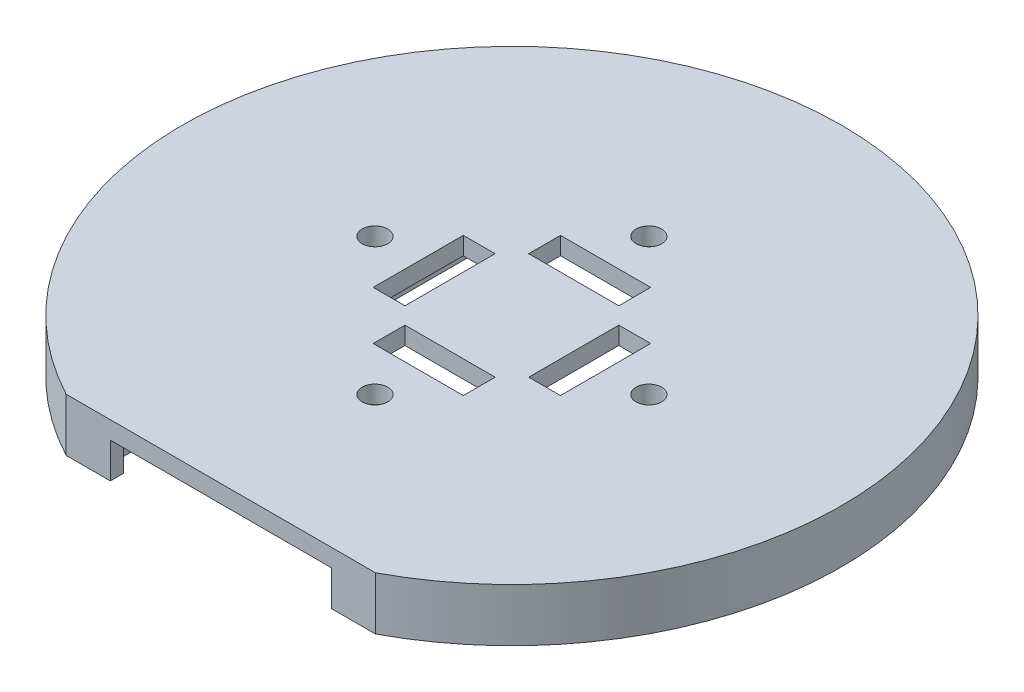
ISO-10303-21;
HEADER;
FILE_DESCRIPTION(('STEP AP214'),'2;1');
FILE_NAME('part.step','',(''),(''),'','','');
FILE_SCHEMA(('AUTOMOTIVE_DESIGN { 1 0 10303 214 1 1 1 1 }'));
ENDSEC;
DATA;
#1=APPLICATION_CONTEXT('core data for automotive mechanical design processes');
#2=APPLICATION_PROTOCOL_DEFINITION('international standard','automotive_design',2000,#1);
#3=PRODUCT_CONTEXT('',#1,'mechanical');
#4=PRODUCT('Part','Part','',(#3));
#5=PRODUCT_RELATED_PRODUCT_CATEGORY('part','',(#4));
#6=PRODUCT_DEFINITION_FORMATION('','',#4);
#7=PRODUCT_DEFINITION_CONTEXT('part definition',#1,'design');
#8=PRODUCT_DEFINITION('design','',#6,#7);
#9=PRODUCT_DEFINITION_SHAPE('','',#8);
#10=(LENGTH_UNIT() NAMED_UNIT(*) SI_UNIT(.MILLI.,.METRE.));
#11=(NAMED_UNIT(*) PLANE_ANGLE_UNIT() SI_UNIT($,.RADIAN.));
#12=(NAMED_UNIT(*) SI_UNIT($,.STERADIAN.) SOLID_ANGLE_UNIT());
#13=UNCERTAINTY_MEASURE_WITH_UNIT(LENGTH_MEASURE(1.E-05),#10,'distance_accuracy_value','');
#14=(GEOMETRIC_REPRESENTATION_CONTEXT(3) GLOBAL_UNCERTAINTY_ASSIGNED_CONTEXT((#13)) GLOBAL_UNIT_ASSIGNED_CONTEXT((#10,
#11,#12)) REPRESENTATION_CONTEXT('',''));
#15=CARTESIAN_POINT('',(0.,0.,0.));
#16=DIRECTION('',(0.,0.,1.));
#17=DIRECTION('',(1.,0.,0.));
#18=AXIS2_PLACEMENT_3D('',#15,#16,#17);
#19=CARTESIAN_POINT('',(-14.15,4.,31.4399453551459));
#20=DIRECTION('',(0.,0.,1.));
#21=DIRECTION('',(1.,0.,0.));
#22=AXIS2_PLACEMENT_3D('',#19,#20,#21);
#23=PLANE('',#22);
#24=DIRECTION('',(-1.,0.,0.));
#25=VECTOR('',#24,1.);
#26=CARTESIAN_POINT('',(-14.15,0.,31.4399453551459));
#27=LINE('',#26,#25);
#28=CARTESIAN_POINT('',(14.15,0.,31.4399453551459));
#29=VERTEX_POINT('',#28);
#30=CARTESIAN_POINT('',(12.5,0.,31.4399453551459));
#31=VERTEX_POINT('',#30);
#32=EDGE_CURVE('E260',#29,#31,#27,.T.);
#33=ORIENTED_EDGE('',*,*,#32,.T.);
#34=DIRECTION('',(0.,-1.,0.));
#35=VECTOR('',#34,1.);
#36=CARTESIAN_POINT('',(12.5,0.,31.4399453551459));
#37=LINE('',#36,#35);
#38=CARTESIAN_POINT('',(12.5,4.,31.4399453551459));
#39=VERTEX_POINT('',#38);
#40=EDGE_CURVE('E242',#39,#31,#37,.T.);
#41=ORIENTED_EDGE('',*,*,#40,.F.);
#42=DIRECTION('',(-1.,0.,0.));
#43=VECTOR('',#42,1.);
#44=CARTESIAN_POINT('',(-14.15,4.,31.4399453551459));
#45=LINE('',#44,#43);
#46=CARTESIAN_POINT('',(14.15,4.,31.4399453551459));
#47=VERTEX_POINT('',#46);
#48=EDGE_CURVE('E258',#47,#39,#45,.T.);
#49=ORIENTED_EDGE('',*,*,#48,.F.);
#50=DIRECTION('',(0.,-1.,0.));
#51=VECTOR('',#50,1.);
#52=CARTESIAN_POINT('',(14.15,4.,31.4399453551459));
#53=LINE('',#52,#51);
#54=EDGE_CURVE('E288',#47,#29,#53,.T.);
#55=ORIENTED_EDGE('',*,*,#54,.T.);
#56=EDGE_LOOP('',(#33,#41,#49,#55));
#57=FACE_BOUND('',#56,.T.);
#58=ADVANCED_FACE('F42',(#57),#23,.F.);
#59=CARTESIAN_POINT('',(14.15,4.,31.4399453551459));
#60=DIRECTION('',(1.,0.,0.));
#61=DIRECTION('',(0.,0.,-1.));
#62=AXIS2_PLACEMENT_3D('',#59,#60,#61);
#63=PLANE('',#62);
#64=DIRECTION('',(0.,0.,1.));
#65=VECTOR('',#64,1.);
#66=CARTESIAN_POINT('',(14.15,0.,31.4399453551459));
#67=LINE('',#66,#65);
#68=CARTESIAN_POINT('',(14.15,0.,-32.8600546448541));
#69=VERTEX_POINT('',#68);
#70=CARTESIAN_POINT('',(14.15,0.,-0.529150262213086));
#71=VERTEX_POINT('',#70);
#72=EDGE_CURVE('E289',#69,#71,#67,.T.);
#73=ORIENTED_EDGE('',*,*,#72,.T.);
#74=DIRECTION('',(0.,1.,0.));
#75=VECTOR('',#74,1.);
#76=CARTESIAN_POINT('',(14.15,0.,-0.529150262213088));
#77=LINE('',#76,#75);
#78=CARTESIAN_POINT('',(14.15,4.,-0.529150262213086));
#79=VERTEX_POINT('',#78);
#80=EDGE_CURVE('E512',#71,#79,#77,.T.);
#81=ORIENTED_EDGE('',*,*,#80,.T.);
#82=DIRECTION('',(0.,0.,1.));
#83=VECTOR('',#82,1.);
#84=CARTESIAN_POINT('',(14.15,4.,31.4399453551459));
#85=LINE('',#84,#83);
#86=CARTESIAN_POINT('',(14.15,4.,-32.8600546448541));
#87=VERTEX_POINT('',#86);
#88=EDGE_CURVE('E278',#87,#79,#85,.T.);
#89=ORIENTED_EDGE('',*,*,#88,.F.);
#90=DIRECTION('',(0.,-1.,0.));
#91=VECTOR('',#90,1.);
#92=CARTESIAN_POINT('',(14.15,4.,-32.8600546448541));
#93=LINE('',#92,#91);
#94=EDGE_CURVE('E306',#87,#69,#93,.T.);
#95=ORIENTED_EDGE('',*,*,#94,.T.);
#96=EDGE_LOOP('',(#73,#81,#89,#95));
#97=FACE_BOUND('',#96,.T.);
#98=ADVANCED_FACE('F628',(#97),#63,.F.);
#99=CARTESIAN_POINT('',(-14.15,4.,31.4399453551459));
#100=DIRECTION('',(-1.,0.,0.));
#101=DIRECTION('',(0.,0.,1.));
#102=AXIS2_PLACEMENT_3D('',#99,#100,#101);
#103=PLANE('',#102);
#104=DIRECTION('',(0.,0.,-1.));
#105=VECTOR('',#104,1.);
#106=CARTESIAN_POINT('',(-14.15,0.,31.4399453551459));
#107=LINE('',#106,#105);
#108=CARTESIAN_POINT('',(-14.15,0.,31.4399453551459));
#109=VERTEX_POINT('',#108);
#110=CARTESIAN_POINT('',(-14.15,0.,0.529150262212975));
#111=VERTEX_POINT('',#110);
#112=EDGE_CURVE('E298',#109,#111,#107,.T.);
#113=ORIENTED_EDGE('',*,*,#112,.T.);
#114=DIRECTION('',(0.,1.,0.));
#115=VECTOR('',#114,1.);
#116=CARTESIAN_POINT('',(-14.15,0.,0.529150262212975));
#117=LINE('',#116,#115);
#118=CARTESIAN_POINT('',(-14.15,4.,0.529150262212975));
#119=VERTEX_POINT('',#118);
#120=EDGE_CURVE('E410',#111,#119,#117,.T.);
#121=ORIENTED_EDGE('',*,*,#120,.T.);
#122=DIRECTION('',(0.,0.,-1.));
#123=VECTOR('',#122,1.);
#124=CARTESIAN_POINT('',(-14.15,4.,31.4399453551459));
#125=LINE('',#124,#123);
#126=CARTESIAN_POINT('',(-14.15,4.,31.4399453551459));
#127=VERTEX_POINT('',#126);
#128=EDGE_CURVE('E276',#127,#119,#125,.T.);
#129=ORIENTED_EDGE('',*,*,#128,.F.);
#130=DIRECTION('',(0.,-1.,0.));
#131=VECTOR('',#130,1.);
#132=CARTESIAN_POINT('',(-14.15,4.,31.4399453551459));
#133=LINE('',#132,#131);
#134=EDGE_CURVE('E314',#127,#109,#133,.T.);
#135=ORIENTED_EDGE('',*,*,#134,.T.);
#136=EDGE_LOOP('',(#113,#121,#129,#135));
#137=FACE_BOUND('',#136,.T.);
#138=ADVANCED_FACE('F416',(#137),#103,.F.);
#139=CARTESIAN_POINT('',(0.,6.,0.));
#140=DIRECTION('',(0.,-1.,0.));
#141=DIRECTION('',(0.,0.,-1.));
#142=AXIS2_PLACEMENT_3D('',#139,#140,#141);
#143=CYLINDRICAL_SURFACE('',#142,37.3);
#144=CARTESIAN_POINT('',(0.,0.,0.));
#145=DIRECTION('',(0.,1.,0.));
#146=DIRECTION('',(0.,0.,1.));
#147=AXIS2_PLACEMENT_3D('',#144,#145,#146);
#148=CIRCLE('',#147,37.3);
#149=CARTESIAN_POINT('',(17.5,0.,32.9399453551459));
#150=VERTEX_POINT('',#149);
#151=CARTESIAN_POINT('',(-17.5,0.,32.9399453551459));
#152=VERTEX_POINT('',#151);
#153=EDGE_CURVE('E309',#150,#152,#148,.T.);
#154=ORIENTED_EDGE('',*,*,#153,.T.);
#155=DIRECTION('',(0.,-1.,0.));
#156=VECTOR('',#155,1.);
#157=CARTESIAN_POINT('',(-17.5,6.,32.9399453551459));
#158=LINE('',#157,#156);
#159=CARTESIAN_POINT('',(-17.5,6.,32.9399453551459));
#160=VERTEX_POINT('',#159);
#161=EDGE_CURVE('E339',#160,#152,#158,.T.);
#162=ORIENTED_EDGE('',*,*,#161,.F.);
#163=CARTESIAN_POINT('',(0.,6.,0.));
#164=DIRECTION('',(0.,1.,0.));
#165=DIRECTION('',(0.,0.,1.));
#166=AXIS2_PLACEMENT_3D('',#163,#164,#165);
#167=CIRCLE('',#166,37.3);
#168=CARTESIAN_POINT('',(17.5,6.,32.9399453551459));
#169=VERTEX_POINT('',#168);
#170=EDGE_CURVE('E320',#169,#160,#167,.T.);
#171=ORIENTED_EDGE('',*,*,#170,.F.);
#172=DIRECTION('',(0.,-1.,0.));
#173=VECTOR('',#172,1.);
#174=CARTESIAN_POINT('',(17.5,6.,32.9399453551459));
#175=LINE('',#174,#173);
#176=EDGE_CURVE('E328',#169,#150,#175,.T.);
#177=ORIENTED_EDGE('',*,*,#176,.T.);
#178=EDGE_LOOP('',(#154,#162,#171,#177));
#179=FACE_BOUND('',#178,.T.);
#180=ADVANCED_FACE('F44',(#179),#143,.T.);
#181=CARTESIAN_POINT('',(-17.5,6.,32.9399453551459));
#182=DIRECTION('',(0.,0.,-1.));
#183=DIRECTION('',(-1.,0.,0.));
#184=AXIS2_PLACEMENT_3D('',#181,#182,#183);
#185=PLANE('',#184);
#186=DIRECTION('',(-1.,0.,0.));
#187=VECTOR('',#186,1.);
#188=CARTESIAN_POINT('',(-12.5,4.,32.9399453551459));
#189=LINE('',#188,#187);
#190=CARTESIAN_POINT('',(12.5,4.,32.9399453551459));
#191=VERTEX_POINT('',#190);
#192=CARTESIAN_POINT('',(-12.5,4.,32.9399453551459));
#193=VERTEX_POINT('',#192);
#194=EDGE_CURVE('E683',#191,#193,#189,.T.);
#195=ORIENTED_EDGE('',*,*,#194,.F.);
#196=DIRECTION('',(0.,1.,0.));
#197=VECTOR('',#196,1.);
#198=CARTESIAN_POINT('',(12.5,0.,32.9399453551459));
#199=LINE('',#198,#197);
#200=CARTESIAN_POINT('',(12.5,0.,32.9399453551459));
#201=VERTEX_POINT('',#200);
#202=EDGE_CURVE('E245',#201,#191,#199,.T.);
#203=ORIENTED_EDGE('',*,*,#202,.F.);
#204=DIRECTION('',(1.,0.,0.));
#205=VECTOR('',#204,1.);
#206=CARTESIAN_POINT('',(-17.5,0.,32.9399453551459));
#207=LINE('',#206,#205);
#208=EDGE_CURVE('E332',#201,#150,#207,.T.);
#209=ORIENTED_EDGE('',*,*,#208,.T.);
#210=ORIENTED_EDGE('',*,*,#176,.F.);
#211=DIRECTION('',(1.,0.,0.));
#212=VECTOR('',#211,1.);
#213=CARTESIAN_POINT('',(-17.5,6.,32.9399453551459));
#214=LINE('',#213,#212);
#215=EDGE_CURVE('E324',#160,#169,#214,.T.);
#216=ORIENTED_EDGE('',*,*,#215,.F.);
#217=ORIENTED_EDGE('',*,*,#161,.T.);
#218=CARTESIAN_POINT('',(-12.5,0.,32.9399453551459));
#219=VERTEX_POINT('',#218);
#220=EDGE_CURVE('E325',#152,#219,#207,.T.);
#221=ORIENTED_EDGE('',*,*,#220,.T.);
#222=DIRECTION('',(0.,-1.,0.));
#223=VECTOR('',#222,1.);
#224=CARTESIAN_POINT('',(-12.5,0.,32.9399453551459));
#225=LINE('',#224,#223);
#226=EDGE_CURVE('E262',#193,#219,#225,.T.);
#227=ORIENTED_EDGE('',*,*,#226,.F.);
#228=EDGE_LOOP('',(#195,#203,#209,#210,#216,#217,#221,#227));
#229=FACE_BOUND('',#228,.T.);
#230=ADVANCED_FACE('F552',(#229),#185,.F.);
#231=CARTESIAN_POINT('',(0.,6.,0.));
#232=DIRECTION('',(0.,1.,0.));
#233=DIRECTION('',(0.,0.,1.));
#234=AXIS2_PLACEMENT_3D('',#231,#232,#233);
#235=PLANE('',#234);
#236=CARTESIAN_POINT('',(15.5,6.,-1.62353882256206E-13));
#237=DIRECTION('',(0.,1.,0.));
#238=DIRECTION('',(-1.,0.,0.));
#239=AXIS2_PLACEMENT_3D('',#236,#237,#238);
#240=CIRCLE('',#239,1.45);
#241=CARTESIAN_POINT('',(14.05,6.,-1.47165938432238E-13));
#242=VERTEX_POINT('',#241);
#243=EDGE_CURVE('E479',#242,#242,#240,.T.);
#244=ORIENTED_EDGE('',*,*,#243,.F.);
#245=EDGE_LOOP('',(#244));
#246=FACE_BOUND('',#245,.T.);
#247=CARTESIAN_POINT('',(-15.5,6.,0.));
#248=DIRECTION('',(0.,1.,0.));
#249=DIRECTION('',(1.,0.,0.));
#250=AXIS2_PLACEMENT_3D('',#247,#248,#249);
#251=CIRCLE('',#250,1.45);
#252=CARTESIAN_POINT('',(-14.05,6.,0.));
#253=VERTEX_POINT('',#252);
#254=EDGE_CURVE('E435',#253,#253,#251,.T.);
#255=ORIENTED_EDGE('',*,*,#254,.F.);
#256=EDGE_LOOP('',(#255));
#257=FACE_BOUND('',#256,.T.);
#258=DIRECTION('',(0.,0.,1.));
#259=VECTOR('',#258,1.);
#260=CARTESIAN_POINT('',(-5.1,6.,10.6));
#261=LINE('',#260,#259);
#262=CARTESIAN_POINT('',(-5.1,6.,7.));
#263=VERTEX_POINT('',#262);
#264=CARTESIAN_POINT('',(-5.1,6.,10.6));
#265=VERTEX_POINT('',#264);
#266=EDGE_CURVE('E66',#263,#265,#261,.T.);
#267=ORIENTED_EDGE('',*,*,#266,.F.);
#268=DIRECTION('',(-1.,0.,0.));
#269=VECTOR('',#268,1.);
#270=CARTESIAN_POINT('',(5.1,6.,7.));
#271=LINE('',#270,#269);
#272=CARTESIAN_POINT('',(5.1,6.,7.));
#273=VERTEX_POINT('',#272);
#274=EDGE_CURVE('E459',#273,#263,#271,.T.);
#275=ORIENTED_EDGE('',*,*,#274,.F.);
#276=DIRECTION('',(0.,0.,-1.));
#277=VECTOR('',#276,1.);
#278=CARTESIAN_POINT('',(5.1,6.,10.6));
#279=LINE('',#278,#277);
#280=CARTESIAN_POINT('',(5.1,6.,10.6));
#281=VERTEX_POINT('',#280);
#282=EDGE_CURVE('E455',#281,#273,#279,.T.);
#283=ORIENTED_EDGE('',*,*,#282,.F.);
#284=DIRECTION('',(1.,0.,0.));
#285=VECTOR('',#284,1.);
#286=CARTESIAN_POINT('',(5.1,6.,10.6));
#287=LINE('',#286,#285);
#288=EDGE_CURVE('E450',#265,#281,#287,.T.);
#289=ORIENTED_EDGE('',*,*,#288,.F.);
#290=EDGE_LOOP('',(#267,#275,#283,#289));
#291=FACE_BOUND('',#290,.T.);
#292=CARTESIAN_POINT('',(0.,6.,15.5));
#293=DIRECTION('',(0.,1.,0.));
#294=DIRECTION('',(0.,0.,-1.));
#295=AXIS2_PLACEMENT_3D('',#292,#293,#294);
#296=CIRCLE('',#295,1.45);
#297=CARTESIAN_POINT('',(0.,6.,14.05));
#298=VERTEX_POINT('',#297);
#299=EDGE_CURVE('E451',#298,#298,#296,.T.);
#300=ORIENTED_EDGE('',*,*,#299,.F.);
#301=EDGE_LOOP('',(#300));
#302=FACE_BOUND('',#301,.T.);
#303=DIRECTION('',(1.,0.,0.));
#304=VECTOR('',#303,1.);
#305=CARTESIAN_POINT('',(10.6000000000001,6.,5.09999999999989));
#306=LINE('',#305,#304);
#307=CARTESIAN_POINT('',(7.00000000000005,6.,5.09999999999993));
#308=VERTEX_POINT('',#307);
#309=CARTESIAN_POINT('',(10.6000000000001,6.,5.09999999999989));
#310=VERTEX_POINT('',#309);
#311=EDGE_CURVE('E478',#308,#310,#306,.T.);
#312=ORIENTED_EDGE('',*,*,#311,.F.);
#313=DIRECTION('',(0.,0.,1.));
#314=VECTOR('',#313,1.);
#315=CARTESIAN_POINT('',(6.99999999999995,6.,-5.10000000000007));
#316=LINE('',#315,#314);
#317=CARTESIAN_POINT('',(6.99999999999995,6.,-5.10000000000007));
#318=VERTEX_POINT('',#317);
#319=EDGE_CURVE('E582',#318,#308,#316,.T.);
#320=ORIENTED_EDGE('',*,*,#319,.F.);
#321=DIRECTION('',(-1.,0.,0.));
#322=VECTOR('',#321,1.);
#323=CARTESIAN_POINT('',(10.5999999999999,6.,-5.10000000000011));
#324=LINE('',#323,#322);
#325=CARTESIAN_POINT('',(10.5999999999999,6.,-5.10000000000011));
#326=VERTEX_POINT('',#325);
#327=EDGE_CURVE('E578',#326,#318,#324,.T.);
#328=ORIENTED_EDGE('',*,*,#327,.F.);
#329=DIRECTION('',(0.,0.,-1.));
#330=VECTOR('',#329,1.);
#331=CARTESIAN_POINT('',(10.5999999999999,6.,-5.10000000000011));
#332=LINE('',#331,#330);
#333=EDGE_CURVE('E574',#310,#326,#332,.T.);
#334=ORIENTED_EDGE('',*,*,#333,.F.);
#335=EDGE_LOOP('',(#312,#320,#328,#334));
#336=FACE_BOUND('',#335,.T.);
#337=DIRECTION('',(-1.,0.,0.));
#338=VECTOR('',#337,1.);
#339=CARTESIAN_POINT('',(-10.6,6.,-5.09999999999996));
#340=LINE('',#339,#338);
#341=CARTESIAN_POINT('',(-7.00000000000002,6.,-5.09999999999997));
#342=VERTEX_POINT('',#341);
#343=CARTESIAN_POINT('',(-10.6,6.,-5.09999999999996));
#344=VERTEX_POINT('',#343);
#345=EDGE_CURVE('E434',#342,#344,#340,.T.);
#346=ORIENTED_EDGE('',*,*,#345,.F.);
#347=DIRECTION('',(0.,0.,-1.));
#348=VECTOR('',#347,1.);
#349=CARTESIAN_POINT('',(-6.99999999999998,6.,5.10000000000002));
#350=LINE('',#349,#348);
#351=CARTESIAN_POINT('',(-6.99999999999998,6.,5.10000000000002));
#352=VERTEX_POINT('',#351);
#353=EDGE_CURVE('E491',#352,#342,#350,.T.);
#354=ORIENTED_EDGE('',*,*,#353,.F.);
#355=DIRECTION('',(1.,0.,0.));
#356=VECTOR('',#355,1.);
#357=CARTESIAN_POINT('',(-10.6,6.,5.10000000000004));
#358=LINE('',#357,#356);
#359=CARTESIAN_POINT('',(-10.6,6.,5.10000000000004));
#360=VERTEX_POINT('',#359);
#361=EDGE_CURVE('E487',#360,#352,#358,.T.);
#362=ORIENTED_EDGE('',*,*,#361,.F.);
#363=DIRECTION('',(0.,0.,1.));
#364=VECTOR('',#363,1.);
#365=CARTESIAN_POINT('',(-10.6,6.,5.10000000000004));
#366=LINE('',#365,#364);
#367=EDGE_CURVE('E439',#344,#360,#366,.T.);
#368=ORIENTED_EDGE('',*,*,#367,.F.);
#369=EDGE_LOOP('',(#346,#354,#362,#368));
#370=FACE_BOUND('',#369,.T.);
#371=DIRECTION('',(0.,0.,-1.));
#372=VECTOR('',#371,1.);
#373=CARTESIAN_POINT('',(5.1,6.,-10.6));
#374=LINE('',#373,#372);
#375=CARTESIAN_POINT('',(5.1,6.,-7.));
#376=VERTEX_POINT('',#375);
#377=CARTESIAN_POINT('',(5.1,6.,-10.6));
#378=VERTEX_POINT('',#377);
#379=EDGE_CURVE('E517',#376,#378,#374,.T.);
#380=ORIENTED_EDGE('',*,*,#379,.F.);
#381=DIRECTION('',(1.,0.,0.));
#382=VECTOR('',#381,1.);
#383=CARTESIAN_POINT('',(-5.1,6.,-7.));
#384=LINE('',#383,#382);
#385=CARTESIAN_POINT('',(-5.1,6.,-7.));
#386=VERTEX_POINT('',#385);
#387=EDGE_CURVE('E528',#386,#376,#384,.T.);
#388=ORIENTED_EDGE('',*,*,#387,.F.);
#389=DIRECTION('',(0.,0.,1.));
#390=VECTOR('',#389,1.);
#391=CARTESIAN_POINT('',(-5.1,6.,-10.6));
#392=LINE('',#391,#390);
#393=CARTESIAN_POINT('',(-5.1,6.,-10.6));
#394=VERTEX_POINT('',#393);
#395=EDGE_CURVE('E524',#394,#386,#392,.T.);
#396=ORIENTED_EDGE('',*,*,#395,.F.);
#397=DIRECTION('',(-1.,0.,0.));
#398=VECTOR('',#397,1.);
#399=CARTESIAN_POINT('',(-5.1,6.,-10.6));
#400=LINE('',#399,#398);
#401=EDGE_CURVE('E520',#378,#394,#400,.T.);
#402=ORIENTED_EDGE('',*,*,#401,.F.);
#403=EDGE_LOOP('',(#380,#388,#396,#402));
#404=FACE_BOUND('',#403,.T.);
#405=CARTESIAN_POINT('',(0.,6.,-15.5));
#406=DIRECTION('',(0.,1.,0.));
#407=DIRECTION('',(0.,0.,1.));
#408=AXIS2_PLACEMENT_3D('',#405,#406,#407);
#409=CIRCLE('',#408,1.45);
#410=CARTESIAN_POINT('',(0.,6.,-14.05));
#411=VERTEX_POINT('',#410);
#412=EDGE_CURVE('E516',#411,#411,#409,.T.);
#413=ORIENTED_EDGE('',*,*,#412,.F.);
#414=EDGE_LOOP('',(#413));
#415=FACE_BOUND('',#414,.T.);
#416=ORIENTED_EDGE('',*,*,#170,.T.);
#417=ORIENTED_EDGE('',*,*,#215,.T.);
#418=EDGE_LOOP('',(#416,#417));
#419=FACE_BOUND('',#418,.T.);
#420=ADVANCED_FACE('F549',(#246,#257,#291,#302,#336,#370,#404,#415,#419),#235,.T.);
#421=CARTESIAN_POINT('',(0.,0.,0.));
#422=DIRECTION('',(0.,1.,0.));
#423=DIRECTION('',(0.,0.,1.));
#424=AXIS2_PLACEMENT_3D('',#421,#422,#423);
#425=PLANE('',#424);
#426=ORIENTED_EDGE('',*,*,#208,.F.);
#427=DIRECTION('',(0.,0.,1.));
#428=VECTOR('',#427,1.);
#429=CARTESIAN_POINT('',(12.5,0.,-37.301));
#430=LINE('',#429,#428);
#431=EDGE_CURVE('E252',#31,#201,#430,.T.);
#432=ORIENTED_EDGE('',*,*,#431,.F.);
#433=ORIENTED_EDGE('',*,*,#32,.F.);
#434=CARTESIAN_POINT('',(14.15,0.,0.529150262212761));
#435=VERTEX_POINT('',#434);
#436=EDGE_CURVE('E294',#435,#29,#67,.T.);
#437=ORIENTED_EDGE('',*,*,#436,.F.);
#438=CARTESIAN_POINT('',(15.5,0.,-1.62353882256206E-13));
#439=DIRECTION('',(0.,1.,0.));
#440=DIRECTION('',(-1.,0.,0.));
#441=AXIS2_PLACEMENT_3D('',#438,#439,#440);
#442=CIRCLE('',#441,1.45);
#443=EDGE_CURVE('E474',#435,#71,#442,.T.);
#444=ORIENTED_EDGE('',*,*,#443,.T.);
#445=ORIENTED_EDGE('',*,*,#72,.F.);
#446=DIRECTION('',(1.,0.,0.));
#447=VECTOR('',#446,1.);
#448=CARTESIAN_POINT('',(-14.15,0.,-32.8600546448541));
#449=LINE('',#448,#447);
#450=CARTESIAN_POINT('',(-14.15,0.,-32.8600546448541));
#451=VERTEX_POINT('',#450);
#452=EDGE_CURVE('E302',#451,#69,#449,.T.);
#453=ORIENTED_EDGE('',*,*,#452,.F.);
#454=CARTESIAN_POINT('',(-14.15,0.,-0.529150262212867));
#455=VERTEX_POINT('',#454);
#456=EDGE_CURVE('E297',#455,#451,#107,.T.);
#457=ORIENTED_EDGE('',*,*,#456,.F.);
#458=CARTESIAN_POINT('',(-15.5,0.,0.));
#459=DIRECTION('',(0.,1.,0.));
#460=DIRECTION('',(1.,0.,0.));
#461=AXIS2_PLACEMENT_3D('',#458,#459,#460);
#462=CIRCLE('',#461,1.45);
#463=EDGE_CURVE('E431',#455,#111,#462,.T.);
#464=ORIENTED_EDGE('',*,*,#463,.T.);
#465=ORIENTED_EDGE('',*,*,#112,.F.);
#466=CARTESIAN_POINT('',(-12.5,0.,31.4399453551459));
#467=VERTEX_POINT('',#466);
#468=EDGE_CURVE('E293',#467,#109,#27,.T.);
#469=ORIENTED_EDGE('',*,*,#468,.F.);
#470=DIRECTION('',(0.,0.,1.));
#471=VECTOR('',#470,1.);
#472=CARTESIAN_POINT('',(-12.5,0.,-37.301));
#473=LINE('',#472,#471);
#474=EDGE_CURVE('E482',#467,#219,#473,.T.);
#475=ORIENTED_EDGE('',*,*,#474,.T.);
#476=ORIENTED_EDGE('',*,*,#220,.F.);
#477=ORIENTED_EDGE('',*,*,#153,.F.);
#478=EDGE_LOOP('',(#426,#432,#433,#437,#444,#445,#453,#457,#464,#465,#469,#475,#476,#477));
#479=FACE_BOUND('',#478,.T.);
#480=ADVANCED_FACE('F428',(#479),#425,.F.);
#481=CARTESIAN_POINT('',(14.15,4.,0.529150262212761));
#482=VERTEX_POINT('',#481);
#483=EDGE_CURVE('E268',#482,#47,#85,.T.);
#484=ORIENTED_EDGE('',*,*,#483,.F.);
#485=DIRECTION('',(0.,1.,0.));
#486=VECTOR('',#485,1.);
#487=CARTESIAN_POINT('',(14.15,0.,0.529150262212763));
#488=LINE('',#487,#486);
#489=EDGE_CURVE('E419',#482,#435,#488,.F.);
#490=ORIENTED_EDGE('',*,*,#489,.T.);
#491=ORIENTED_EDGE('',*,*,#436,.T.);
#492=ORIENTED_EDGE('',*,*,#54,.F.);
#493=EDGE_LOOP('',(#484,#490,#491,#492));
#494=FACE_BOUND('',#493,.T.);
#495=ADVANCED_FACE('F637',(#494),#63,.F.);
#496=CARTESIAN_POINT('',(-14.15,4.,-32.8600546448541));
#497=DIRECTION('',(0.,0.,-1.));
#498=DIRECTION('',(-1.,0.,0.));
#499=AXIS2_PLACEMENT_3D('',#496,#497,#498);
#500=PLANE('',#499);
#501=ORIENTED_EDGE('',*,*,#452,.T.);
#502=ORIENTED_EDGE('',*,*,#94,.F.);
#503=DIRECTION('',(1.,0.,0.));
#504=VECTOR('',#503,1.);
#505=CARTESIAN_POINT('',(-14.15,4.,-32.8600546448541));
#506=LINE('',#505,#504);
#507=CARTESIAN_POINT('',(-14.15,4.,-32.8600546448541));
#508=VERTEX_POINT('',#507);
#509=EDGE_CURVE('E284',#508,#87,#506,.T.);
#510=ORIENTED_EDGE('',*,*,#509,.F.);
#511=DIRECTION('',(0.,-1.,0.));
#512=VECTOR('',#511,1.);
#513=CARTESIAN_POINT('',(-14.15,4.,-32.8600546448541));
#514=LINE('',#513,#512);
#515=EDGE_CURVE('E310',#508,#451,#514,.T.);
#516=ORIENTED_EDGE('',*,*,#515,.T.);
#517=EDGE_LOOP('',(#501,#502,#510,#516));
#518=FACE_BOUND('',#517,.T.);
#519=ADVANCED_FACE('F648',(#518),#500,.F.);
#520=CARTESIAN_POINT('',(-14.15,4.,-0.529150262212867));
#521=VERTEX_POINT('',#520);
#522=EDGE_CURVE('E271',#521,#508,#125,.T.);
#523=ORIENTED_EDGE('',*,*,#522,.F.);
#524=DIRECTION('',(0.,1.,0.));
#525=VECTOR('',#524,1.);
#526=CARTESIAN_POINT('',(-14.15,0.,-0.529150262212867));
#527=LINE('',#526,#525);
#528=EDGE_CURVE('E392',#521,#455,#527,.F.);
#529=ORIENTED_EDGE('',*,*,#528,.T.);
#530=ORIENTED_EDGE('',*,*,#456,.T.);
#531=ORIENTED_EDGE('',*,*,#515,.F.);
#532=EDGE_LOOP('',(#523,#529,#530,#531));
#533=FACE_BOUND('',#532,.T.);
#534=ADVANCED_FACE('F640',(#533),#103,.F.);
#535=CARTESIAN_POINT('',(-12.5,4.,31.4399453551459));
#536=VERTEX_POINT('',#535);
#537=EDGE_CURVE('E272',#536,#127,#45,.T.);
#538=ORIENTED_EDGE('',*,*,#537,.F.);
#539=DIRECTION('',(0.,1.,0.));
#540=VECTOR('',#539,1.);
#541=CARTESIAN_POINT('',(-12.5,0.,31.4399453551459));
#542=LINE('',#541,#540);
#543=EDGE_CURVE('E58',#467,#536,#542,.T.);
#544=ORIENTED_EDGE('',*,*,#543,.F.);
#545=ORIENTED_EDGE('',*,*,#468,.T.);
#546=ORIENTED_EDGE('',*,*,#134,.F.);
#547=EDGE_LOOP('',(#538,#544,#545,#546));
#548=FACE_BOUND('',#547,.T.);
#549=ADVANCED_FACE('F424',(#548),#23,.F.);
#550=CARTESIAN_POINT('',(0.,4.,0.));
#551=DIRECTION('',(0.,-1.,0.));
#552=DIRECTION('',(0.,0.,-1.));
#553=AXIS2_PLACEMENT_3D('',#550,#551,#552);
#554=PLANE('',#553);
#555=CARTESIAN_POINT('',(15.5,4.,-1.62353882256206E-13));
#556=DIRECTION('',(0.,-1.,0.));
#557=DIRECTION('',(0.,0.,-1.));
#558=AXIS2_PLACEMENT_3D('',#555,#556,#557);
#559=CIRCLE('',#558,1.45);
#560=EDGE_CURVE('E11',#482,#79,#559,.T.);
#561=ORIENTED_EDGE('',*,*,#560,.F.);
#562=ORIENTED_EDGE('',*,*,#483,.T.);
#563=ORIENTED_EDGE('',*,*,#48,.T.);
#564=DIRECTION('',(0.,0.,1.));
#565=VECTOR('',#564,1.);
#566=CARTESIAN_POINT('',(12.5,4.,-37.301));
#567=LINE('',#566,#565);
#568=EDGE_CURVE('E239',#39,#191,#567,.T.);
#569=ORIENTED_EDGE('',*,*,#568,.T.);
#570=ORIENTED_EDGE('',*,*,#194,.T.);
#571=DIRECTION('',(0.,0.,1.));
#572=VECTOR('',#571,1.);
#573=CARTESIAN_POINT('',(-12.5,4.,-37.301));
#574=LINE('',#573,#572);
#575=EDGE_CURVE('E251',#536,#193,#574,.T.);
#576=ORIENTED_EDGE('',*,*,#575,.F.);
#577=ORIENTED_EDGE('',*,*,#537,.T.);
#578=ORIENTED_EDGE('',*,*,#128,.T.);
#579=CARTESIAN_POINT('',(-15.5,4.,0.));
#580=DIRECTION('',(0.,-1.,0.));
#581=DIRECTION('',(0.,0.,-1.));
#582=AXIS2_PLACEMENT_3D('',#579,#580,#581);
#583=CIRCLE('',#582,1.45);
#584=EDGE_CURVE('E51',#521,#119,#583,.T.);
#585=ORIENTED_EDGE('',*,*,#584,.F.);
#586=ORIENTED_EDGE('',*,*,#522,.T.);
#587=ORIENTED_EDGE('',*,*,#509,.T.);
#588=ORIENTED_EDGE('',*,*,#88,.T.);
#589=EDGE_LOOP('',(#561,#562,#563,#569,#570,#576,#577,#578,#585,#586,#587,#588));
#590=FACE_BOUND('',#589,.T.);
#591=DIRECTION('',(0.,0.,-1.));
#592=VECTOR('',#591,1.);
#593=CARTESIAN_POINT('',(-5.1,4.,0.));
#594=LINE('',#593,#592);
#595=CARTESIAN_POINT('',(-5.1,4.,10.6));
#596=VERTEX_POINT('',#595);
#597=CARTESIAN_POINT('',(-5.1,4.,7.));
#598=VERTEX_POINT('',#597);
#599=EDGE_CURVE('E403',#596,#598,#594,.T.);
#600=ORIENTED_EDGE('',*,*,#599,.F.);
#601=DIRECTION('',(-1.,0.,0.));
#602=VECTOR('',#601,1.);
#603=CARTESIAN_POINT('',(0.,4.,10.6));
#604=LINE('',#603,#602);
#605=CARTESIAN_POINT('',(5.1,4.,10.6));
#606=VERTEX_POINT('',#605);
#607=EDGE_CURVE('E387',#606,#596,#604,.T.);
#608=ORIENTED_EDGE('',*,*,#607,.F.);
#609=DIRECTION('',(0.,0.,1.));
#610=VECTOR('',#609,1.);
#611=CARTESIAN_POINT('',(5.1,4.,0.));
#612=LINE('',#611,#610);
#613=CARTESIAN_POINT('',(5.1,4.,7.));
#614=VERTEX_POINT('',#613);
#615=EDGE_CURVE('E396',#614,#606,#612,.T.);
#616=ORIENTED_EDGE('',*,*,#615,.F.);
#617=DIRECTION('',(1.,0.,0.));
#618=VECTOR('',#617,1.);
#619=CARTESIAN_POINT('',(0.,4.,7.));
#620=LINE('',#619,#618);
#621=EDGE_CURVE('E400',#598,#614,#620,.T.);
#622=ORIENTED_EDGE('',*,*,#621,.F.);
#623=EDGE_LOOP('',(#600,#608,#616,#622));
#624=FACE_BOUND('',#623,.T.);
#625=CARTESIAN_POINT('',(0.,4.,15.5));
#626=DIRECTION('',(0.,-1.,0.));
#627=DIRECTION('',(0.,0.,-1.));
#628=AXIS2_PLACEMENT_3D('',#625,#626,#627);
#629=CIRCLE('',#628,1.45);
#630=CARTESIAN_POINT('',(0.,4.,14.05));
#631=VERTEX_POINT('',#630);
#632=EDGE_CURVE('E388',#631,#631,#629,.T.);
#633=ORIENTED_EDGE('',*,*,#632,.F.);
#634=EDGE_LOOP('',(#633));
#635=FACE_BOUND('',#634,.T.);
#636=DIRECTION('',(-1.,0.,0.));
#637=VECTOR('',#636,1.);
#638=CARTESIAN_POINT('',(0.,4.,5.1));
#639=LINE('',#638,#637);
#640=CARTESIAN_POINT('',(10.6000000000001,4.,5.09999999999989));
#641=VERTEX_POINT('',#640);
#642=CARTESIAN_POINT('',(7.00000000000005,4.,5.09999999999993));
#643=VERTEX_POINT('',#642);
#644=EDGE_CURVE('E384',#641,#643,#639,.T.);
#645=ORIENTED_EDGE('',*,*,#644,.F.);
#646=DIRECTION('',(0.,0.,1.));
#647=VECTOR('',#646,1.);
#648=CARTESIAN_POINT('',(10.6,4.,-1.11029106575212E-13));
#649=LINE('',#648,#647);
#650=CARTESIAN_POINT('',(10.5999999999999,4.,-5.10000000000011));
#651=VERTEX_POINT('',#650);
#652=EDGE_CURVE('E374',#651,#641,#649,.T.);
#653=ORIENTED_EDGE('',*,*,#652,.F.);
#654=DIRECTION('',(1.,0.,0.));
#655=VECTOR('',#654,1.);
#656=CARTESIAN_POINT('',(0.,4.,-5.1));
#657=LINE('',#656,#655);
#658=CARTESIAN_POINT('',(6.99999999999995,4.,-5.10000000000007));
#659=VERTEX_POINT('',#658);
#660=EDGE_CURVE('E377',#659,#651,#657,.T.);
#661=ORIENTED_EDGE('',*,*,#660,.F.);
#662=DIRECTION('',(0.,0.,-1.));
#663=VECTOR('',#662,1.);
#664=CARTESIAN_POINT('',(7.,4.,0.));
#665=LINE('',#664,#663);
#666=EDGE_CURVE('E381',#643,#659,#665,.T.);
#667=ORIENTED_EDGE('',*,*,#666,.F.);
#668=EDGE_LOOP('',(#645,#653,#661,#667));
#669=FACE_BOUND('',#668,.T.);
#670=DIRECTION('',(1.,0.,0.));
#671=VECTOR('',#670,1.);
#672=CARTESIAN_POINT('',(0.,4.,-5.1));
#673=LINE('',#672,#671);
#674=CARTESIAN_POINT('',(-10.6,4.,-5.09999999999996));
#675=VERTEX_POINT('',#674);
#676=CARTESIAN_POINT('',(-7.00000000000002,4.,-5.09999999999997));
#677=VERTEX_POINT('',#676);
#678=EDGE_CURVE('E371',#675,#677,#673,.T.);
#679=ORIENTED_EDGE('',*,*,#678,.F.);
#680=DIRECTION('',(0.,0.,-1.));
#681=VECTOR('',#680,1.);
#682=CARTESIAN_POINT('',(-10.6,4.,0.));
#683=LINE('',#682,#681);
#684=CARTESIAN_POINT('',(-10.6,4.,5.10000000000004));
#685=VERTEX_POINT('',#684);
#686=EDGE_CURVE('E361',#685,#675,#683,.T.);
#687=ORIENTED_EDGE('',*,*,#686,.F.);
#688=DIRECTION('',(-1.,0.,0.));
#689=VECTOR('',#688,1.);
#690=CARTESIAN_POINT('',(0.,4.,5.1));
#691=LINE('',#690,#689);
#692=CARTESIAN_POINT('',(-6.99999999999998,4.,5.10000000000002));
#693=VERTEX_POINT('',#692);
#694=EDGE_CURVE('E364',#693,#685,#691,.T.);
#695=ORIENTED_EDGE('',*,*,#694,.F.);
#696=DIRECTION('',(0.,0.,1.));
#697=VECTOR('',#696,1.);
#698=CARTESIAN_POINT('',(-7.,4.,0.));
#699=LINE('',#698,#697);
#700=EDGE_CURVE('E368',#677,#693,#699,.T.);
#701=ORIENTED_EDGE('',*,*,#700,.F.);
#702=EDGE_LOOP('',(#679,#687,#695,#701));
#703=FACE_BOUND('',#702,.T.);
#704=DIRECTION('',(0.,0.,1.));
#705=VECTOR('',#704,1.);
#706=CARTESIAN_POINT('',(5.1,4.,0.));
#707=LINE('',#706,#705);
#708=CARTESIAN_POINT('',(5.1,4.,-10.6));
#709=VERTEX_POINT('',#708);
#710=CARTESIAN_POINT('',(5.1,4.,-7.));
#711=VERTEX_POINT('',#710);
#712=EDGE_CURVE('E358',#709,#711,#707,.T.);
#713=ORIENTED_EDGE('',*,*,#712,.F.);
#714=DIRECTION('',(1.,0.,0.));
#715=VECTOR('',#714,1.);
#716=CARTESIAN_POINT('',(0.,4.,-10.6));
#717=LINE('',#716,#715);
#718=CARTESIAN_POINT('',(-5.1,4.,-10.6));
#719=VERTEX_POINT('',#718);
#720=EDGE_CURVE('E343',#719,#709,#717,.T.);
#721=ORIENTED_EDGE('',*,*,#720,.F.);
#722=DIRECTION('',(0.,0.,-1.));
#723=VECTOR('',#722,1.);
#724=CARTESIAN_POINT('',(-5.1,4.,0.));
#725=LINE('',#724,#723);
#726=CARTESIAN_POINT('',(-5.1,4.,-7.));
#727=VERTEX_POINT('',#726);
#728=EDGE_CURVE('E351',#727,#719,#725,.T.);
#729=ORIENTED_EDGE('',*,*,#728,.F.);
#730=DIRECTION('',(-1.,0.,0.));
#731=VECTOR('',#730,1.);
#732=CARTESIAN_POINT('',(0.,4.,-7.));
#733=LINE('',#732,#731);
#734=EDGE_CURVE('E355',#711,#727,#733,.T.);
#735=ORIENTED_EDGE('',*,*,#734,.F.);
#736=EDGE_LOOP('',(#713,#721,#729,#735));
#737=FACE_BOUND('',#736,.T.);
#738=CARTESIAN_POINT('',(0.,4.,-15.5));
#739=DIRECTION('',(0.,-1.,0.));
#740=DIRECTION('',(0.,0.,-1.));
#741=AXIS2_PLACEMENT_3D('',#738,#739,#740);
#742=CIRCLE('',#741,1.45);
#743=CARTESIAN_POINT('',(0.,4.,-16.95));
#744=VERTEX_POINT('',#743);
#745=EDGE_CURVE('E344',#744,#744,#742,.T.);
#746=ORIENTED_EDGE('',*,*,#745,.F.);
#747=EDGE_LOOP('',(#746));
#748=FACE_BOUND('',#747,.T.);
#749=ADVANCED_FACE('F265',(#590,#624,#635,#669,#703,#737,#748),#554,.T.);
#750=CARTESIAN_POINT('',(0.,0.,-15.5));
#751=DIRECTION('',(0.,1.,0.));
#752=DIRECTION('',(0.,0.,1.));
#753=AXIS2_PLACEMENT_3D('',#750,#751,#752);
#754=CYLINDRICAL_SURFACE('',#753,1.45);
#755=ORIENTED_EDGE('',*,*,#745,.T.);
#756=EDGE_LOOP('',(#755));
#757=FACE_BOUND('',#756,.T.);
#758=ORIENTED_EDGE('',*,*,#412,.T.);
#759=EDGE_LOOP('',(#758));
#760=FACE_BOUND('',#759,.T.);
#761=ADVANCED_FACE('F547',(#757,#760),#754,.F.);
#762=CARTESIAN_POINT('',(5.1,0.,-10.6));
#763=DIRECTION('',(1.,0.,0.));
#764=DIRECTION('',(0.,0.,-1.));
#765=AXIS2_PLACEMENT_3D('',#762,#763,#764);
#766=PLANE('',#765);
#767=ORIENTED_EDGE('',*,*,#712,.T.);
#768=DIRECTION('',(0.,1.,0.));
#769=VECTOR('',#768,1.);
#770=CARTESIAN_POINT('',(5.1,0.,-7.));
#771=LINE('',#770,#769);
#772=EDGE_CURVE('E348',#711,#376,#771,.T.);
#773=ORIENTED_EDGE('',*,*,#772,.T.);
#774=ORIENTED_EDGE('',*,*,#379,.T.);
#775=DIRECTION('',(0.,1.,0.));
#776=VECTOR('',#775,1.);
#777=CARTESIAN_POINT('',(5.1,0.,-10.6));
#778=LINE('',#777,#776);
#779=EDGE_CURVE('E532',#709,#378,#778,.T.);
#780=ORIENTED_EDGE('',*,*,#779,.F.);
#781=EDGE_LOOP('',(#767,#773,#774,#780));
#782=FACE_BOUND('',#781,.T.);
#783=ADVANCED_FACE('F755',(#782),#766,.F.);
#784=CARTESIAN_POINT('',(-5.1,0.,-7.));
#785=DIRECTION('',(0.,0.,1.));
#786=DIRECTION('',(1.,0.,0.));
#787=AXIS2_PLACEMENT_3D('',#784,#785,#786);
#788=PLANE('',#787);
#789=ORIENTED_EDGE('',*,*,#734,.T.);
#790=DIRECTION('',(0.,1.,0.));
#791=VECTOR('',#790,1.);
#792=CARTESIAN_POINT('',(-5.1,0.,-7.));
#793=LINE('',#792,#791);
#794=EDGE_CURVE('E535',#727,#386,#793,.T.);
#795=ORIENTED_EDGE('',*,*,#794,.T.);
#796=ORIENTED_EDGE('',*,*,#387,.T.);
#797=ORIENTED_EDGE('',*,*,#772,.F.);
#798=EDGE_LOOP('',(#789,#795,#796,#797));
#799=FACE_BOUND('',#798,.T.);
#800=ADVANCED_FACE('F751',(#799),#788,.F.);
#801=CARTESIAN_POINT('',(-5.1,0.,-10.6));
#802=DIRECTION('',(-1.,0.,0.));
#803=DIRECTION('',(0.,0.,1.));
#804=AXIS2_PLACEMENT_3D('',#801,#802,#803);
#805=PLANE('',#804);
#806=ORIENTED_EDGE('',*,*,#728,.T.);
#807=DIRECTION('',(0.,1.,0.));
#808=VECTOR('',#807,1.);
#809=CARTESIAN_POINT('',(-5.1,0.,-10.6));
#810=LINE('',#809,#808);
#811=EDGE_CURVE('E538',#719,#394,#810,.T.);
#812=ORIENTED_EDGE('',*,*,#811,.T.);
#813=ORIENTED_EDGE('',*,*,#395,.T.);
#814=ORIENTED_EDGE('',*,*,#794,.F.);
#815=EDGE_LOOP('',(#806,#812,#813,#814));
#816=FACE_BOUND('',#815,.T.);
#817=ADVANCED_FACE('F754',(#816),#805,.F.);
#818=CARTESIAN_POINT('',(-5.1,0.,-10.6));
#819=DIRECTION('',(0.,0.,-1.));
#820=DIRECTION('',(-1.,0.,0.));
#821=AXIS2_PLACEMENT_3D('',#818,#819,#820);
#822=PLANE('',#821);
#823=ORIENTED_EDGE('',*,*,#720,.T.);
#824=ORIENTED_EDGE('',*,*,#779,.T.);
#825=ORIENTED_EDGE('',*,*,#401,.T.);
#826=ORIENTED_EDGE('',*,*,#811,.F.);
#827=EDGE_LOOP('',(#823,#824,#825,#826));
#828=FACE_BOUND('',#827,.T.);
#829=ADVANCED_FACE('F749',(#828),#822,.F.);
#830=CARTESIAN_POINT('',(-10.6,0.,-5.09999999999996));
#831=DIRECTION('',(0.,0.,-1.));
#832=DIRECTION('',(-1.,0.,0.));
#833=AXIS2_PLACEMENT_3D('',#830,#831,#832);
#834=PLANE('',#833);
#835=ORIENTED_EDGE('',*,*,#678,.T.);
#836=DIRECTION('',(0.,1.,0.));
#837=VECTOR('',#836,1.);
#838=CARTESIAN_POINT('',(-7.00000000000002,0.,-5.09999999999997));
#839=LINE('',#838,#837);
#840=EDGE_CURVE('E393',#677,#342,#839,.T.);
#841=ORIENTED_EDGE('',*,*,#840,.T.);
#842=ORIENTED_EDGE('',*,*,#345,.T.);
#843=DIRECTION('',(0.,1.,0.));
#844=VECTOR('',#843,1.);
#845=CARTESIAN_POINT('',(-10.6,0.,-5.09999999999996));
#846=LINE('',#845,#844);
#847=EDGE_CURVE('E495',#675,#344,#846,.T.);
#848=ORIENTED_EDGE('',*,*,#847,.F.);
#849=EDGE_LOOP('',(#835,#841,#842,#848));
#850=FACE_BOUND('',#849,.T.);
#851=ADVANCED_FACE('F739',(#850),#834,.F.);
#852=CARTESIAN_POINT('',(-6.99999999999998,0.,5.10000000000002));
#853=DIRECTION('',(1.,0.,0.));
#854=DIRECTION('',(0.,0.,-1.));
#855=AXIS2_PLACEMENT_3D('',#852,#853,#854);
#856=PLANE('',#855);
#857=ORIENTED_EDGE('',*,*,#700,.T.);
#858=DIRECTION('',(0.,1.,0.));
#859=VECTOR('',#858,1.);
#860=CARTESIAN_POINT('',(-6.99999999999998,0.,5.10000000000002));
#861=LINE('',#860,#859);
#862=EDGE_CURVE('E498',#693,#352,#861,.T.);
#863=ORIENTED_EDGE('',*,*,#862,.T.);
#864=ORIENTED_EDGE('',*,*,#353,.T.);
#865=ORIENTED_EDGE('',*,*,#840,.F.);
#866=EDGE_LOOP('',(#857,#863,#864,#865));
#867=FACE_BOUND('',#866,.T.);
#868=ADVANCED_FACE('F735',(#867),#856,.F.);
#869=CARTESIAN_POINT('',(-10.6,0.,5.10000000000004));
#870=DIRECTION('',(0.,0.,1.));
#871=DIRECTION('',(1.,0.,0.));
#872=AXIS2_PLACEMENT_3D('',#869,#870,#871);
#873=PLANE('',#872);
#874=ORIENTED_EDGE('',*,*,#694,.T.);
#875=DIRECTION('',(0.,1.,0.));
#876=VECTOR('',#875,1.);
#877=CARTESIAN_POINT('',(-10.6,0.,5.10000000000004));
#878=LINE('',#877,#876);
#879=EDGE_CURVE('E501',#685,#360,#878,.T.);
#880=ORIENTED_EDGE('',*,*,#879,.T.);
#881=ORIENTED_EDGE('',*,*,#361,.T.);
#882=ORIENTED_EDGE('',*,*,#862,.F.);
#883=EDGE_LOOP('',(#874,#880,#881,#882));
#884=FACE_BOUND('',#883,.T.);
#885=ADVANCED_FACE('F738',(#884),#873,.F.);
#886=CARTESIAN_POINT('',(-10.6,0.,5.10000000000004));
#887=DIRECTION('',(-1.,0.,0.));
#888=DIRECTION('',(0.,0.,1.));
#889=AXIS2_PLACEMENT_3D('',#886,#887,#888);
#890=PLANE('',#889);
#891=ORIENTED_EDGE('',*,*,#686,.T.);
#892=ORIENTED_EDGE('',*,*,#847,.T.);
#893=ORIENTED_EDGE('',*,*,#367,.T.);
#894=ORIENTED_EDGE('',*,*,#879,.F.);
#895=EDGE_LOOP('',(#891,#892,#893,#894));
#896=FACE_BOUND('',#895,.T.);
#897=ADVANCED_FACE('F624',(#896),#890,.F.);
#898=CARTESIAN_POINT('',(10.6000000000001,0.,5.09999999999989));
#899=DIRECTION('',(0.,0.,1.));
#900=DIRECTION('',(1.,0.,0.));
#901=AXIS2_PLACEMENT_3D('',#898,#899,#900);
#902=PLANE('',#901);
#903=ORIENTED_EDGE('',*,*,#644,.T.);
#904=DIRECTION('',(0.,1.,0.));
#905=VECTOR('',#904,1.);
#906=CARTESIAN_POINT('',(7.00000000000005,0.,5.09999999999993));
#907=LINE('',#906,#905);
#908=EDGE_CURVE('E571',#643,#308,#907,.T.);
#909=ORIENTED_EDGE('',*,*,#908,.T.);
#910=ORIENTED_EDGE('',*,*,#311,.T.);
#911=DIRECTION('',(0.,1.,0.));
#912=VECTOR('',#911,1.);
#913=CARTESIAN_POINT('',(10.6000000000001,0.,5.09999999999989));
#914=LINE('',#913,#912);
#915=EDGE_CURVE('E445',#641,#310,#914,.T.);
#916=ORIENTED_EDGE('',*,*,#915,.F.);
#917=EDGE_LOOP('',(#903,#909,#910,#916));
#918=FACE_BOUND('',#917,.T.);
#919=ADVANCED_FACE('F615',(#918),#902,.F.);
#920=CARTESIAN_POINT('',(6.99999999999995,0.,-5.10000000000007));
#921=DIRECTION('',(-1.,0.,0.));
#922=DIRECTION('',(0.,0.,1.));
#923=AXIS2_PLACEMENT_3D('',#920,#921,#922);
#924=PLANE('',#923);
#925=ORIENTED_EDGE('',*,*,#666,.T.);
#926=DIRECTION('',(0.,1.,0.));
#927=VECTOR('',#926,1.);
#928=CARTESIAN_POINT('',(6.99999999999995,0.,-5.10000000000007));
#929=LINE('',#928,#927);
#930=EDGE_CURVE('E588',#659,#318,#929,.T.);
#931=ORIENTED_EDGE('',*,*,#930,.T.);
#932=ORIENTED_EDGE('',*,*,#319,.T.);
#933=ORIENTED_EDGE('',*,*,#908,.F.);
#934=EDGE_LOOP('',(#925,#931,#932,#933));
#935=FACE_BOUND('',#934,.T.);
#936=ADVANCED_FACE('F616',(#935),#924,.F.);
#937=CARTESIAN_POINT('',(10.5999999999999,0.,-5.10000000000011));
#938=DIRECTION('',(0.,0.,-1.));
#939=DIRECTION('',(-1.,0.,0.));
#940=AXIS2_PLACEMENT_3D('',#937,#938,#939);
#941=PLANE('',#940);
#942=ORIENTED_EDGE('',*,*,#660,.T.);
#943=DIRECTION('',(0.,1.,0.));
#944=VECTOR('',#943,1.);
#945=CARTESIAN_POINT('',(10.5999999999999,0.,-5.10000000000011));
#946=LINE('',#945,#944);
#947=EDGE_CURVE('E590',#651,#326,#946,.T.);
#948=ORIENTED_EDGE('',*,*,#947,.T.);
#949=ORIENTED_EDGE('',*,*,#327,.T.);
#950=ORIENTED_EDGE('',*,*,#930,.F.);
#951=EDGE_LOOP('',(#942,#948,#949,#950));
#952=FACE_BOUND('',#951,.T.);
#953=ADVANCED_FACE('F608',(#952),#941,.F.);
#954=CARTESIAN_POINT('',(10.5999999999999,0.,-5.10000000000011));
#955=DIRECTION('',(1.,0.,0.));
#956=DIRECTION('',(0.,0.,-1.));
#957=AXIS2_PLACEMENT_3D('',#954,#955,#956);
#958=PLANE('',#957);
#959=ORIENTED_EDGE('',*,*,#652,.T.);
#960=ORIENTED_EDGE('',*,*,#915,.T.);
#961=ORIENTED_EDGE('',*,*,#333,.T.);
#962=ORIENTED_EDGE('',*,*,#947,.F.);
#963=EDGE_LOOP('',(#959,#960,#961,#962));
#964=FACE_BOUND('',#963,.T.);
#965=ADVANCED_FACE('F598',(#964),#958,.F.);
#966=CARTESIAN_POINT('',(0.,0.,15.5));
#967=DIRECTION('',(0.,1.,0.));
#968=DIRECTION('',(0.,0.,1.));
#969=AXIS2_PLACEMENT_3D('',#966,#967,#968);
#970=CYLINDRICAL_SURFACE('',#969,1.45);
#971=ORIENTED_EDGE('',*,*,#632,.T.);
#972=EDGE_LOOP('',(#971));
#973=FACE_BOUND('',#972,.T.);
#974=ORIENTED_EDGE('',*,*,#299,.T.);
#975=EDGE_LOOP('',(#974));
#976=FACE_BOUND('',#975,.T.);
#977=ADVANCED_FACE('F699',(#973,#976),#970,.F.);
#978=CARTESIAN_POINT('',(-5.1,0.,10.6));
#979=DIRECTION('',(-1.,0.,0.));
#980=DIRECTION('',(0.,0.,1.));
#981=AXIS2_PLACEMENT_3D('',#978,#979,#980);
#982=PLANE('',#981);
#983=ORIENTED_EDGE('',*,*,#599,.T.);
#984=DIRECTION('',(0.,1.,0.));
#985=VECTOR('',#984,1.);
#986=CARTESIAN_POINT('',(-5.1,0.,7.));
#987=LINE('',#986,#985);
#988=EDGE_CURVE('E442',#598,#263,#987,.T.);
#989=ORIENTED_EDGE('',*,*,#988,.T.);
#990=ORIENTED_EDGE('',*,*,#266,.T.);
#991=DIRECTION('',(0.,1.,0.));
#992=VECTOR('',#991,1.);
#993=CARTESIAN_POINT('',(-5.1,0.,10.6));
#994=LINE('',#993,#992);
#995=EDGE_CURVE('E463',#596,#265,#994,.T.);
#996=ORIENTED_EDGE('',*,*,#995,.F.);
#997=EDGE_LOOP('',(#983,#989,#990,#996));
#998=FACE_BOUND('',#997,.T.);
#999=ADVANCED_FACE('F701',(#998),#982,.F.);
#1000=CARTESIAN_POINT('',(5.1,0.,7.));
#1001=DIRECTION('',(0.,0.,-1.));
#1002=DIRECTION('',(-1.,0.,0.));
#1003=AXIS2_PLACEMENT_3D('',#1000,#1001,#1002);
#1004=PLANE('',#1003);
#1005=ORIENTED_EDGE('',*,*,#621,.T.);
#1006=DIRECTION('',(0.,1.,0.));
#1007=VECTOR('',#1006,1.);
#1008=CARTESIAN_POINT('',(5.1,0.,7.));
#1009=LINE('',#1008,#1007);
#1010=EDGE_CURVE('E466',#614,#273,#1009,.T.);
#1011=ORIENTED_EDGE('',*,*,#1010,.T.);
#1012=ORIENTED_EDGE('',*,*,#274,.T.);
#1013=ORIENTED_EDGE('',*,*,#988,.F.);
#1014=EDGE_LOOP('',(#1005,#1011,#1012,#1013));
#1015=FACE_BOUND('',#1014,.T.);
#1016=ADVANCED_FACE('F707',(#1015),#1004,.F.);
#1017=CARTESIAN_POINT('',(5.1,0.,10.6));
#1018=DIRECTION('',(1.,0.,0.));
#1019=DIRECTION('',(0.,0.,-1.));
#1020=AXIS2_PLACEMENT_3D('',#1017,#1018,#1019);
#1021=PLANE('',#1020);
#1022=ORIENTED_EDGE('',*,*,#615,.T.);
#1023=DIRECTION('',(0.,1.,0.));
#1024=VECTOR('',#1023,1.);
#1025=CARTESIAN_POINT('',(5.1,0.,10.6));
#1026=LINE('',#1025,#1024);
#1027=EDGE_CURVE('E469',#606,#281,#1026,.T.);
#1028=ORIENTED_EDGE('',*,*,#1027,.T.);
#1029=ORIENTED_EDGE('',*,*,#282,.T.);
#1030=ORIENTED_EDGE('',*,*,#1010,.F.);
#1031=EDGE_LOOP('',(#1022,#1028,#1029,#1030));
#1032=FACE_BOUND('',#1031,.T.);
#1033=ADVANCED_FACE('F724',(#1032),#1021,.F.);
#1034=CARTESIAN_POINT('',(5.1,0.,10.6));
#1035=DIRECTION('',(0.,0.,1.));
#1036=DIRECTION('',(1.,0.,0.));
#1037=AXIS2_PLACEMENT_3D('',#1034,#1035,#1036);
#1038=PLANE('',#1037);
#1039=ORIENTED_EDGE('',*,*,#607,.T.);
#1040=ORIENTED_EDGE('',*,*,#995,.T.);
#1041=ORIENTED_EDGE('',*,*,#288,.T.);
#1042=ORIENTED_EDGE('',*,*,#1027,.F.);
#1043=EDGE_LOOP('',(#1039,#1040,#1041,#1042));
#1044=FACE_BOUND('',#1043,.T.);
#1045=ADVANCED_FACE('F720',(#1044),#1038,.F.);
#1046=CARTESIAN_POINT('',(-15.5,0.,0.));
#1047=DIRECTION('',(0.,1.,0.));
#1048=DIRECTION('',(0.,0.,1.));
#1049=AXIS2_PLACEMENT_3D('',#1046,#1047,#1048);
#1050=CYLINDRICAL_SURFACE('',#1049,1.45);
#1051=ORIENTED_EDGE('',*,*,#254,.T.);
#1052=EDGE_LOOP('',(#1051));
#1053=FACE_BOUND('',#1052,.T.);
#1054=ORIENTED_EDGE('',*,*,#463,.F.);
#1055=ORIENTED_EDGE('',*,*,#528,.F.);
#1056=ORIENTED_EDGE('',*,*,#584,.T.);
#1057=ORIENTED_EDGE('',*,*,#120,.F.);
#1058=EDGE_LOOP('',(#1054,#1055,#1056,#1057));
#1059=FACE_BOUND('',#1058,.T.);
#1060=ADVANCED_FACE('F409',(#1053,#1059),#1050,.F.);
#1061=CARTESIAN_POINT('',(15.5,0.,-1.62353882256206E-13));
#1062=DIRECTION('',(0.,1.,0.));
#1063=DIRECTION('',(0.,0.,1.));
#1064=AXIS2_PLACEMENT_3D('',#1061,#1062,#1063);
#1065=CYLINDRICAL_SURFACE('',#1064,1.45);
#1066=ORIENTED_EDGE('',*,*,#243,.T.);
#1067=EDGE_LOOP('',(#1066));
#1068=FACE_BOUND('',#1067,.T.);
#1069=ORIENTED_EDGE('',*,*,#443,.F.);
#1070=ORIENTED_EDGE('',*,*,#489,.F.);
#1071=ORIENTED_EDGE('',*,*,#560,.T.);
#1072=ORIENTED_EDGE('',*,*,#80,.F.);
#1073=EDGE_LOOP('',(#1069,#1070,#1071,#1072));
#1074=FACE_BOUND('',#1073,.T.);
#1075=ADVANCED_FACE('F677',(#1068,#1074),#1065,.F.);
#1076=CARTESIAN_POINT('',(12.5,0.,-37.301));
#1077=DIRECTION('',(1.,0.,0.));
#1078=DIRECTION('',(0.,0.,-1.));
#1079=AXIS2_PLACEMENT_3D('',#1076,#1077,#1078);
#1080=PLANE('',#1079);
#1081=ORIENTED_EDGE('',*,*,#40,.T.);
#1082=ORIENTED_EDGE('',*,*,#431,.T.);
#1083=ORIENTED_EDGE('',*,*,#202,.T.);
#1084=ORIENTED_EDGE('',*,*,#568,.F.);
#1085=EDGE_LOOP('',(#1081,#1082,#1083,#1084));
#1086=FACE_BOUND('',#1085,.T.);
#1087=ADVANCED_FACE('F241',(#1086),#1080,.F.);
#1088=CARTESIAN_POINT('',(-12.5,0.,-37.301));
#1089=DIRECTION('',(-1.,0.,0.));
#1090=DIRECTION('',(0.,0.,1.));
#1091=AXIS2_PLACEMENT_3D('',#1088,#1089,#1090);
#1092=PLANE('',#1091);
#1093=ORIENTED_EDGE('',*,*,#543,.T.);
#1094=ORIENTED_EDGE('',*,*,#575,.T.);
#1095=ORIENTED_EDGE('',*,*,#226,.T.);
#1096=ORIENTED_EDGE('',*,*,#474,.F.);
#1097=EDGE_LOOP('',(#1093,#1094,#1095,#1096));
#1098=FACE_BOUND('',#1097,.T.);
#1099=ADVANCED_FACE('F692',(#1098),#1092,.F.);
#1100=CLOSED_SHELL('',(#58,#98,#138,#180,#230,#420,#480,#495,#519,#534,#549,#749,#761,#783,#800,
#817,#829,#851,#868,#885,#897,#919,#936,#953,#965,#977,#999,#1016,#1033,#1045,#1060,#1075,#1087,#1099));
#1101=MANIFOLD_SOLID_BREP('B2',#1100);
#1102=ADVANCED_BREP_SHAPE_REPRESENTATION('',(#18,#1101),#14);
#1103=SHAPE_DEFINITION_REPRESENTATION(#9,#1102);
ENDSEC;
END-ISO-10303-21;
